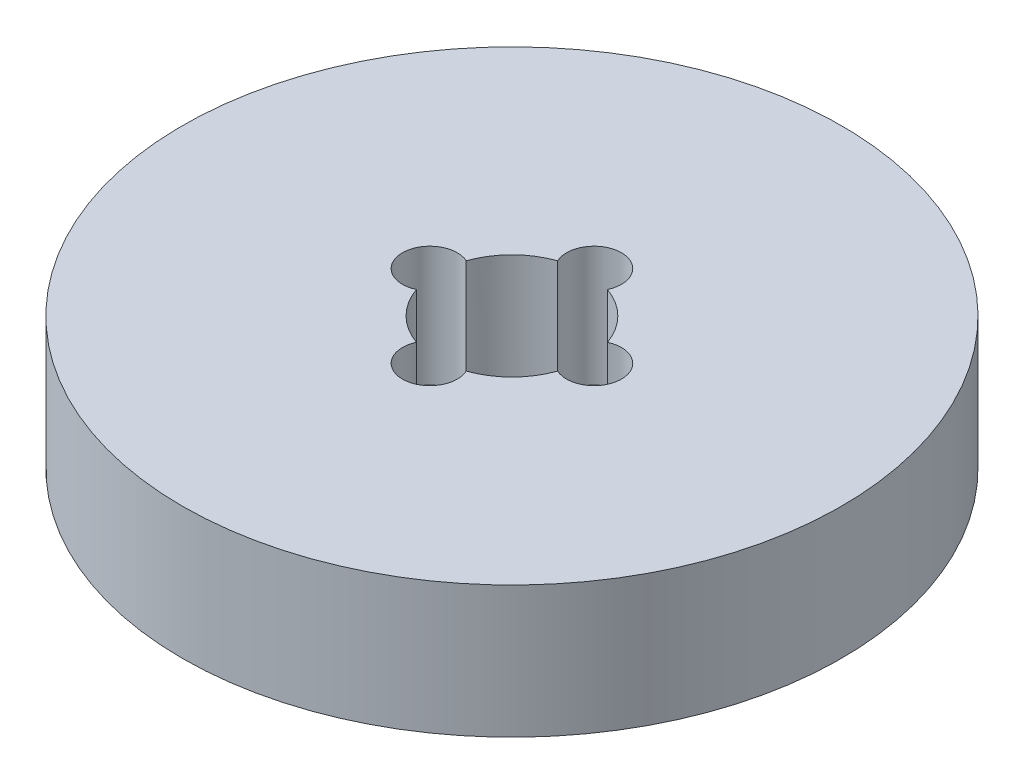
ISO-10303-21;
HEADER;
FILE_DESCRIPTION(('STEP AP214'),'2;1');
FILE_NAME('part.step','',(''),(''),'','','');
FILE_SCHEMA(('AUTOMOTIVE_DESIGN { 1 0 10303 214 1 1 1 1 }'));
ENDSEC;
DATA;
#1=APPLICATION_CONTEXT('core data for automotive mechanical design processes');
#2=APPLICATION_PROTOCOL_DEFINITION('international standard','automotive_design',2000,#1);
#3=PRODUCT_CONTEXT('',#1,'mechanical');
#4=PRODUCT('Part','Part','',(#3));
#5=PRODUCT_RELATED_PRODUCT_CATEGORY('part','',(#4));
#6=PRODUCT_DEFINITION_FORMATION('','',#4);
#7=PRODUCT_DEFINITION_CONTEXT('part definition',#1,'design');
#8=PRODUCT_DEFINITION('design','',#6,#7);
#9=PRODUCT_DEFINITION_SHAPE('','',#8);
#10=(LENGTH_UNIT() NAMED_UNIT(*) SI_UNIT(.MILLI.,.METRE.));
#11=(NAMED_UNIT(*) PLANE_ANGLE_UNIT() SI_UNIT($,.RADIAN.));
#12=(NAMED_UNIT(*) SI_UNIT($,.STERADIAN.) SOLID_ANGLE_UNIT());
#13=UNCERTAINTY_MEASURE_WITH_UNIT(LENGTH_MEASURE(1.E-05),#10,'distance_accuracy_value','');
#14=(GEOMETRIC_REPRESENTATION_CONTEXT(3) GLOBAL_UNCERTAINTY_ASSIGNED_CONTEXT((#13)) GLOBAL_UNIT_ASSIGNED_CONTEXT((#10,
#11,#12)) REPRESENTATION_CONTEXT('',''));
#15=CARTESIAN_POINT('',(0.,0.,0.));
#16=DIRECTION('',(0.,0.,1.));
#17=DIRECTION('',(1.,0.,0.));
#18=AXIS2_PLACEMENT_3D('',#15,#16,#17);
#19=CARTESIAN_POINT('',(0.,22.,0.));
#20=DIRECTION('',(0.,-1.,0.));
#21=DIRECTION('',(0.,0.,-1.));
#22=AXIS2_PLACEMENT_3D('',#19,#20,#21);
#23=CYLINDRICAL_SURFACE('',#22,55.);
#24=CARTESIAN_POINT('',(0.,22.,0.));
#25=DIRECTION('',(0.,1.,0.));
#26=DIRECTION('',(0.,0.,1.));
#27=AXIS2_PLACEMENT_3D('',#24,#25,#26);
#28=CIRCLE('',#27,55.);
#29=CARTESIAN_POINT('',(0.,22.,55.));
#30=VERTEX_POINT('',#29);
#31=EDGE_CURVE('E145',#30,#30,#28,.T.);
#32=ORIENTED_EDGE('',*,*,#31,.F.);
#33=EDGE_LOOP('',(#32));
#34=FACE_BOUND('',#33,.T.);
#35=CARTESIAN_POINT('',(0.,0.,0.));
#36=DIRECTION('',(0.,1.,0.));
#37=DIRECTION('',(0.,0.,1.));
#38=AXIS2_PLACEMENT_3D('',#35,#36,#37);
#39=CIRCLE('',#38,55.);
#40=CARTESIAN_POINT('',(0.,0.,55.));
#41=VERTEX_POINT('',#40);
#42=EDGE_CURVE('E143',#41,#41,#39,.T.);
#43=ORIENTED_EDGE('',*,*,#42,.T.);
#44=EDGE_LOOP('',(#43));
#45=FACE_BOUND('',#44,.T.);
#46=ADVANCED_FACE('F39',(#34,#45),#23,.T.);
#47=CARTESIAN_POINT('',(0.,22.,0.));
#48=DIRECTION('',(0.,1.,0.));
#49=DIRECTION('',(0.,0.,1.));
#50=AXIS2_PLACEMENT_3D('',#47,#48,#49);
#51=PLANE('',#50);
#52=CARTESIAN_POINT('',(0.,22.,13.6970711332425));
#53=DIRECTION('',(0.,1.,0.));
#54=DIRECTION('',(1.,0.,0.));
#55=AXIS2_PLACEMENT_3D('',#52,#53,#54);
#56=CIRCLE('',#55,4.57568676827639);
#57=CARTESIAN_POINT('',(-4.15841968309432,22.,11.7880255233544));
#58=VERTEX_POINT('',#57);
#59=CARTESIAN_POINT('',(4.1584196830944,22.,11.7880255233543));
#60=VERTEX_POINT('',#59);
#61=EDGE_CURVE('E152',#58,#60,#56,.T.);
#62=ORIENTED_EDGE('',*,*,#61,.F.);
#63=CARTESIAN_POINT('',(0.,22.,0.));
#64=DIRECTION('',(0.,1.,0.));
#65=DIRECTION('',(0.,0.,1.));
#66=AXIS2_PLACEMENT_3D('',#63,#64,#65);
#67=CIRCLE('',#66,12.5);
#68=CARTESIAN_POINT('',(-11.7880255233543,22.,4.15841968309436));
#69=VERTEX_POINT('',#68);
#70=EDGE_CURVE('E133',#69,#58,#67,.T.);
#71=ORIENTED_EDGE('',*,*,#70,.F.);
#72=CARTESIAN_POINT('',(-13.6970711332425,22.,0.));
#73=DIRECTION('',(0.,1.,0.));
#74=DIRECTION('',(0.,0.,1.));
#75=AXIS2_PLACEMENT_3D('',#72,#73,#74);
#76=CIRCLE('',#75,4.57568676827639);
#77=CARTESIAN_POINT('',(-11.7880255233543,22.,-4.15841968309436));
#78=VERTEX_POINT('',#77);
#79=EDGE_CURVE('E128',#78,#69,#76,.T.);
#80=ORIENTED_EDGE('',*,*,#79,.F.);
#81=CARTESIAN_POINT('',(-4.15841968309448,22.,-11.7880255233543));
#82=VERTEX_POINT('',#81);
#83=EDGE_CURVE('E121',#82,#78,#67,.T.);
#84=ORIENTED_EDGE('',*,*,#83,.F.);
#85=CARTESIAN_POINT('',(-1.43469204775569E-13,22.,-13.6970711332425));
#86=DIRECTION('',(0.,1.,0.));
#87=DIRECTION('',(-1.,0.,0.));
#88=AXIS2_PLACEMENT_3D('',#85,#86,#87);
#89=CIRCLE('',#88,4.57568676827639);
#90=CARTESIAN_POINT('',(4.15841968309423,22.,-11.7880255233544));
#91=VERTEX_POINT('',#90);
#92=EDGE_CURVE('E105',#91,#82,#89,.T.);
#93=ORIENTED_EDGE('',*,*,#92,.F.);
#94=CARTESIAN_POINT('',(11.7880255233543,22.,-4.15841968309436));
#95=VERTEX_POINT('',#94);
#96=EDGE_CURVE('E131',#95,#91,#67,.T.);
#97=ORIENTED_EDGE('',*,*,#96,.F.);
#98=CARTESIAN_POINT('',(13.6970711332425,22.,0.));
#99=DIRECTION('',(0.,1.,0.));
#100=DIRECTION('',(0.,0.,-1.));
#101=AXIS2_PLACEMENT_3D('',#98,#99,#100);
#102=CIRCLE('',#101,4.57568676827639);
#103=CARTESIAN_POINT('',(11.7880255233543,22.,4.15841968309436));
#104=VERTEX_POINT('',#103);
#105=EDGE_CURVE('E154',#104,#95,#102,.T.);
#106=ORIENTED_EDGE('',*,*,#105,.F.);
#107=EDGE_CURVE('E134',#60,#104,#67,.T.);
#108=ORIENTED_EDGE('',*,*,#107,.F.);
#109=EDGE_LOOP('',(#62,#71,#80,#84,#93,#97,#106,#108));
#110=FACE_BOUND('',#109,.T.);
#111=ORIENTED_EDGE('',*,*,#31,.T.);
#112=EDGE_LOOP('',(#111));
#113=FACE_BOUND('',#112,.T.);
#114=ADVANCED_FACE('F130',(#110,#113),#51,.T.);
#115=CARTESIAN_POINT('',(0.,0.,0.));
#116=DIRECTION('',(0.,1.,0.));
#117=DIRECTION('',(0.,0.,1.));
#118=AXIS2_PLACEMENT_3D('',#115,#116,#117);
#119=PLANE('',#118);
#120=CARTESIAN_POINT('',(0.,0.,0.));
#121=DIRECTION('',(0.,1.,0.));
#122=DIRECTION('',(0.,0.,1.));
#123=AXIS2_PLACEMENT_3D('',#120,#121,#122);
#124=CIRCLE('',#123,12.5);
#125=CARTESIAN_POINT('',(0.,0.,12.5));
#126=VERTEX_POINT('',#125);
#127=EDGE_CURVE('E135',#126,#126,#124,.T.);
#128=ORIENTED_EDGE('',*,*,#127,.T.);
#129=EDGE_LOOP('',(#128));
#130=FACE_BOUND('',#129,.T.);
#131=ORIENTED_EDGE('',*,*,#42,.F.);
#132=EDGE_LOOP('',(#131));
#133=FACE_BOUND('',#132,.T.);
#134=ADVANCED_FACE('F195',(#130,#133),#119,.F.);
#135=CARTESIAN_POINT('',(0.,22.,0.));
#136=DIRECTION('',(0.,-1.,0.));
#137=DIRECTION('',(0.,0.,-1.));
#138=AXIS2_PLACEMENT_3D('',#135,#136,#137);
#139=CYLINDRICAL_SURFACE('',#138,12.5);
#140=DIRECTION('',(0.,1.,0.));
#141=VECTOR('',#140,1.);
#142=CARTESIAN_POINT('',(-4.15841968309432,11.9669659038966,11.7880255233544));
#143=LINE('',#142,#141);
#144=CARTESIAN_POINT('',(-4.15841968309432,1.93393180779319,11.7880255233544));
#145=VERTEX_POINT('',#144);
#146=EDGE_CURVE('E11',#145,#58,#143,.T.);
#147=ORIENTED_EDGE('',*,*,#146,.F.);
#148=CARTESIAN_POINT('',(0.,1.93393180779319,0.));
#149=DIRECTION('',(0.,1.,0.));
#150=DIRECTION('',(0.,0.,1.));
#151=AXIS2_PLACEMENT_3D('',#148,#149,#150);
#152=CIRCLE('',#151,12.5);
#153=CARTESIAN_POINT('',(4.1584196830944,1.93393180779319,11.7880255233543));
#154=VERTEX_POINT('',#153);
#155=EDGE_CURVE('E169',#145,#154,#152,.T.);
#156=ORIENTED_EDGE('',*,*,#155,.T.);
#157=DIRECTION('',(0.,1.,0.));
#158=VECTOR('',#157,1.);
#159=CARTESIAN_POINT('',(4.1584196830944,11.9669659038966,11.7880255233543));
#160=LINE('',#159,#158);
#161=EDGE_CURVE('E46',#60,#154,#160,.F.);
#162=ORIENTED_EDGE('',*,*,#161,.F.);
#163=ORIENTED_EDGE('',*,*,#107,.T.);
#164=DIRECTION('',(0.,1.,0.));
#165=VECTOR('',#164,1.);
#166=CARTESIAN_POINT('',(11.7880255233543,11.9669659038966,4.15841968309436));
#167=LINE('',#166,#165);
#168=CARTESIAN_POINT('',(11.7880255233543,1.93393180779319,4.15841968309436));
#169=VERTEX_POINT('',#168);
#170=EDGE_CURVE('E151',#169,#104,#167,.T.);
#171=ORIENTED_EDGE('',*,*,#170,.F.);
#172=CARTESIAN_POINT('',(0.,1.93393180779319,0.));
#173=DIRECTION('',(0.,1.,0.));
#174=DIRECTION('',(0.,0.,1.));
#175=AXIS2_PLACEMENT_3D('',#172,#173,#174);
#176=CIRCLE('',#175,12.5);
#177=CARTESIAN_POINT('',(11.7880255233543,1.93393180779319,-4.15841968309436));
#178=VERTEX_POINT('',#177);
#179=EDGE_CURVE('E173',#169,#178,#176,.T.);
#180=ORIENTED_EDGE('',*,*,#179,.T.);
#181=DIRECTION('',(0.,1.,0.));
#182=VECTOR('',#181,1.);
#183=CARTESIAN_POINT('',(11.7880255233543,11.9669659038966,-4.15841968309436));
#184=LINE('',#183,#182);
#185=EDGE_CURVE('E168',#95,#178,#184,.F.);
#186=ORIENTED_EDGE('',*,*,#185,.F.);
#187=ORIENTED_EDGE('',*,*,#96,.T.);
#188=DIRECTION('',(0.,1.,0.));
#189=VECTOR('',#188,1.);
#190=CARTESIAN_POINT('',(4.15841968309424,11.9669659038966,-11.7880255233544));
#191=LINE('',#190,#189);
#192=CARTESIAN_POINT('',(4.15841968309423,1.93393180779319,-11.7880255233544));
#193=VERTEX_POINT('',#192);
#194=EDGE_CURVE('E108',#193,#91,#191,.T.);
#195=ORIENTED_EDGE('',*,*,#194,.F.);
#196=CARTESIAN_POINT('',(0.,1.93393180779319,0.));
#197=DIRECTION('',(0.,1.,0.));
#198=DIRECTION('',(0.,0.,1.));
#199=AXIS2_PLACEMENT_3D('',#196,#197,#198);
#200=CIRCLE('',#199,12.5);
#201=CARTESIAN_POINT('',(-4.15841968309448,1.93393180779319,-11.7880255233543));
#202=VERTEX_POINT('',#201);
#203=EDGE_CURVE('E122',#193,#202,#200,.T.);
#204=ORIENTED_EDGE('',*,*,#203,.T.);
#205=DIRECTION('',(0.,1.,0.));
#206=VECTOR('',#205,1.);
#207=CARTESIAN_POINT('',(-4.15841968309448,11.9669659038966,-11.7880255233543));
#208=LINE('',#207,#206);
#209=EDGE_CURVE('E106',#82,#202,#208,.F.);
#210=ORIENTED_EDGE('',*,*,#209,.F.);
#211=ORIENTED_EDGE('',*,*,#83,.T.);
#212=DIRECTION('',(0.,1.,0.));
#213=VECTOR('',#212,1.);
#214=CARTESIAN_POINT('',(-11.7880255233543,11.9669659038966,-4.15841968309436));
#215=LINE('',#214,#213);
#216=CARTESIAN_POINT('',(-11.7880255233543,1.93393180779319,-4.15841968309436));
#217=VERTEX_POINT('',#216);
#218=EDGE_CURVE('E177',#217,#78,#215,.T.);
#219=ORIENTED_EDGE('',*,*,#218,.F.);
#220=CARTESIAN_POINT('',(0.,1.93393180779319,0.));
#221=DIRECTION('',(0.,1.,0.));
#222=DIRECTION('',(0.,0.,1.));
#223=AXIS2_PLACEMENT_3D('',#220,#221,#222);
#224=CIRCLE('',#223,12.5);
#225=CARTESIAN_POINT('',(-11.7880255233543,1.93393180779319,4.15841968309436));
#226=VERTEX_POINT('',#225);
#227=EDGE_CURVE('E185',#217,#226,#224,.T.);
#228=ORIENTED_EDGE('',*,*,#227,.T.);
#229=DIRECTION('',(0.,1.,0.));
#230=VECTOR('',#229,1.);
#231=CARTESIAN_POINT('',(-11.7880255233543,11.9669659038966,4.15841968309436));
#232=LINE('',#231,#230);
#233=EDGE_CURVE('E179',#69,#226,#232,.F.);
#234=ORIENTED_EDGE('',*,*,#233,.F.);
#235=ORIENTED_EDGE('',*,*,#70,.T.);
#236=EDGE_LOOP('',(#147,#156,#162,#163,#171,#180,#186,#187,#195,#204,#210,#211,#219,#228,#234,#235));
#237=FACE_BOUND('',#236,.T.);
#238=ORIENTED_EDGE('',*,*,#127,.F.);
#239=EDGE_LOOP('',(#238));
#240=FACE_BOUND('',#239,.T.);
#241=ADVANCED_FACE('F117',(#237,#240),#139,.F.);
#242=CARTESIAN_POINT('',(-13.6970711332425,1.93393180779319,0.));
#243=DIRECTION('',(0.,1.,0.));
#244=DIRECTION('',(0.,0.,1.));
#245=AXIS2_PLACEMENT_3D('',#242,#243,#244);
#246=CYLINDRICAL_SURFACE('',#245,4.57568676827639);
#247=ORIENTED_EDGE('',*,*,#218,.T.);
#248=ORIENTED_EDGE('',*,*,#79,.T.);
#249=ORIENTED_EDGE('',*,*,#233,.T.);
#250=CARTESIAN_POINT('',(-13.6970711332425,1.93393180779319,0.));
#251=DIRECTION('',(0.,1.,0.));
#252=DIRECTION('',(0.,0.,1.));
#253=AXIS2_PLACEMENT_3D('',#250,#251,#252);
#254=CIRCLE('',#253,4.57568676827639);
#255=EDGE_CURVE('E140',#217,#226,#254,.T.);
#256=ORIENTED_EDGE('',*,*,#255,.F.);
#257=EDGE_LOOP('',(#247,#248,#249,#256));
#258=FACE_BOUND('',#257,.T.);
#259=ADVANCED_FACE('F200',(#258),#246,.F.);
#260=CARTESIAN_POINT('',(-13.6970711332425,1.93393180779319,0.));
#261=DIRECTION('',(0.,1.,0.));
#262=DIRECTION('',(0.,0.,1.));
#263=AXIS2_PLACEMENT_3D('',#260,#261,#262);
#264=PLANE('',#263);
#265=ORIENTED_EDGE('',*,*,#255,.T.);
#266=ORIENTED_EDGE('',*,*,#227,.F.);
#267=EDGE_LOOP('',(#265,#266));
#268=FACE_BOUND('',#267,.T.);
#269=ADVANCED_FACE('F202',(#268),#264,.T.);
#270=CARTESIAN_POINT('',(-1.43469204775569E-13,1.93393180779319,-13.6970711332425));
#271=DIRECTION('',(0.,1.,0.));
#272=DIRECTION('',(0.,0.,1.));
#273=AXIS2_PLACEMENT_3D('',#270,#271,#272);
#274=CYLINDRICAL_SURFACE('',#273,4.57568676827639);
#275=ORIENTED_EDGE('',*,*,#194,.T.);
#276=ORIENTED_EDGE('',*,*,#92,.T.);
#277=ORIENTED_EDGE('',*,*,#209,.T.);
#278=CARTESIAN_POINT('',(-1.43469204775569E-13,1.93393180779319,-13.6970711332425));
#279=DIRECTION('',(0.,1.,0.));
#280=DIRECTION('',(-1.,0.,0.));
#281=AXIS2_PLACEMENT_3D('',#278,#279,#280);
#282=CIRCLE('',#281,4.57568676827639);
#283=EDGE_CURVE('E111',#193,#202,#282,.T.);
#284=ORIENTED_EDGE('',*,*,#283,.F.);
#285=EDGE_LOOP('',(#275,#276,#277,#284));
#286=FACE_BOUND('',#285,.T.);
#287=ADVANCED_FACE('F102',(#286),#274,.F.);
#288=CARTESIAN_POINT('',(-1.43469204775569E-13,1.93393180779319,-13.6970711332425));
#289=DIRECTION('',(0.,1.,0.));
#290=DIRECTION('',(-1.,0.,0.));
#291=AXIS2_PLACEMENT_3D('',#288,#289,#290);
#292=PLANE('',#291);
#293=ORIENTED_EDGE('',*,*,#283,.T.);
#294=ORIENTED_EDGE('',*,*,#203,.F.);
#295=EDGE_LOOP('',(#293,#294));
#296=FACE_BOUND('',#295,.T.);
#297=ADVANCED_FACE('F211',(#296),#292,.T.);
#298=CARTESIAN_POINT('',(13.6970711332425,1.93393180779319,0.));
#299=DIRECTION('',(0.,1.,0.));
#300=DIRECTION('',(0.,0.,1.));
#301=AXIS2_PLACEMENT_3D('',#298,#299,#300);
#302=CYLINDRICAL_SURFACE('',#301,4.57568676827639);
#303=ORIENTED_EDGE('',*,*,#170,.T.);
#304=ORIENTED_EDGE('',*,*,#105,.T.);
#305=ORIENTED_EDGE('',*,*,#185,.T.);
#306=CARTESIAN_POINT('',(13.6970711332425,1.93393180779319,0.));
#307=DIRECTION('',(0.,1.,0.));
#308=DIRECTION('',(0.,0.,-1.));
#309=AXIS2_PLACEMENT_3D('',#306,#307,#308);
#310=CIRCLE('',#309,4.57568676827639);
#311=EDGE_CURVE('E56',#169,#178,#310,.T.);
#312=ORIENTED_EDGE('',*,*,#311,.F.);
#313=EDGE_LOOP('',(#303,#304,#305,#312));
#314=FACE_BOUND('',#313,.T.);
#315=ADVANCED_FACE('F212',(#314),#302,.F.);
#316=CARTESIAN_POINT('',(13.6970711332425,1.93393180779319,0.));
#317=DIRECTION('',(0.,1.,0.));
#318=DIRECTION('',(0.,0.,-1.));
#319=AXIS2_PLACEMENT_3D('',#316,#317,#318);
#320=PLANE('',#319);
#321=ORIENTED_EDGE('',*,*,#311,.T.);
#322=ORIENTED_EDGE('',*,*,#179,.F.);
#323=EDGE_LOOP('',(#321,#322));
#324=FACE_BOUND('',#323,.T.);
#325=ADVANCED_FACE('F217',(#324),#320,.T.);
#326=CARTESIAN_POINT('',(0.,1.93393180779319,13.6970711332425));
#327=DIRECTION('',(0.,1.,0.));
#328=DIRECTION('',(0.,0.,1.));
#329=AXIS2_PLACEMENT_3D('',#326,#327,#328);
#330=CYLINDRICAL_SURFACE('',#329,4.57568676827639);
#331=ORIENTED_EDGE('',*,*,#146,.T.);
#332=ORIENTED_EDGE('',*,*,#61,.T.);
#333=ORIENTED_EDGE('',*,*,#161,.T.);
#334=CARTESIAN_POINT('',(0.,1.93393180779319,13.6970711332425));
#335=DIRECTION('',(0.,1.,0.));
#336=DIRECTION('',(1.,0.,0.));
#337=AXIS2_PLACEMENT_3D('',#334,#335,#336);
#338=CIRCLE('',#337,4.57568676827639);
#339=EDGE_CURVE('E55',#145,#154,#338,.T.);
#340=ORIENTED_EDGE('',*,*,#339,.F.);
#341=EDGE_LOOP('',(#331,#332,#333,#340));
#342=FACE_BOUND('',#341,.T.);
#343=ADVANCED_FACE('F170',(#342),#330,.F.);
#344=CARTESIAN_POINT('',(0.,1.93393180779319,13.6970711332425));
#345=DIRECTION('',(0.,1.,0.));
#346=DIRECTION('',(1.,0.,0.));
#347=AXIS2_PLACEMENT_3D('',#344,#345,#346);
#348=PLANE('',#347);
#349=ORIENTED_EDGE('',*,*,#339,.T.);
#350=ORIENTED_EDGE('',*,*,#155,.F.);
#351=EDGE_LOOP('',(#349,#350));
#352=FACE_BOUND('',#351,.T.);
#353=ADVANCED_FACE('F224',(#352),#348,.T.);
#354=CLOSED_SHELL('',(#46,#114,#134,#241,#259,#269,#287,#297,#315,#325,#343,#353));
#355=MANIFOLD_SOLID_BREP('B2',#354);
#356=ADVANCED_BREP_SHAPE_REPRESENTATION('',(#18,#355),#14);
#357=SHAPE_DEFINITION_REPRESENTATION(#9,#356);
ENDSEC;
END-ISO-10303-21;
